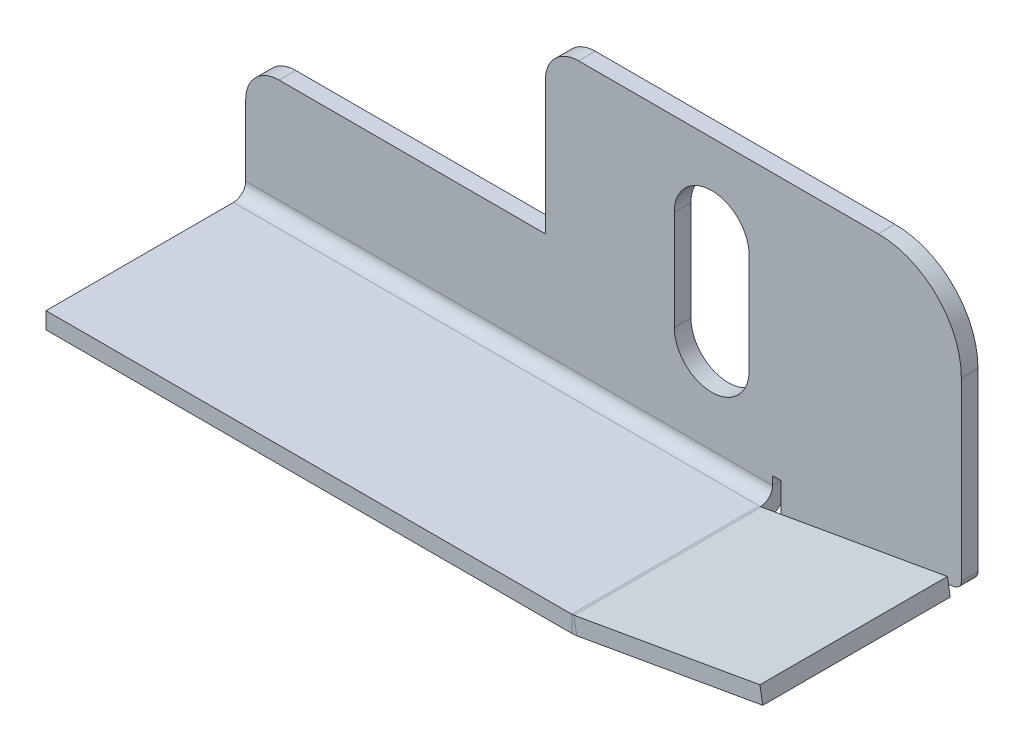
ISO-10303-21;
HEADER;
FILE_DESCRIPTION(('STEP AP214'),'2;1');
FILE_NAME('part.step','',(''),(''),'','','');
FILE_SCHEMA(('AUTOMOTIVE_DESIGN { 1 0 10303 214 1 1 1 1 }'));
ENDSEC;
DATA;
#1=APPLICATION_CONTEXT('core data for automotive mechanical design processes');
#2=APPLICATION_PROTOCOL_DEFINITION('international standard','automotive_design',2000,#1);
#3=PRODUCT_CONTEXT('',#1,'mechanical');
#4=PRODUCT('Part','Part','',(#3));
#5=PRODUCT_RELATED_PRODUCT_CATEGORY('part','',(#4));
#6=PRODUCT_DEFINITION_FORMATION('','',#4);
#7=PRODUCT_DEFINITION_CONTEXT('part definition',#1,'design');
#8=PRODUCT_DEFINITION('design','',#6,#7);
#9=PRODUCT_DEFINITION_SHAPE('','',#8);
#10=(LENGTH_UNIT() NAMED_UNIT(*) SI_UNIT(.MILLI.,.METRE.));
#11=(NAMED_UNIT(*) PLANE_ANGLE_UNIT() SI_UNIT($,.RADIAN.));
#12=(NAMED_UNIT(*) SI_UNIT($,.STERADIAN.) SOLID_ANGLE_UNIT());
#13=UNCERTAINTY_MEASURE_WITH_UNIT(LENGTH_MEASURE(1.E-05),#10,'distance_accuracy_value','');
#14=(GEOMETRIC_REPRESENTATION_CONTEXT(3) GLOBAL_UNCERTAINTY_ASSIGNED_CONTEXT((#13)) GLOBAL_UNIT_ASSIGNED_CONTEXT((#10,
#11,#12)) REPRESENTATION_CONTEXT('',''));
#15=CARTESIAN_POINT('',(0.,0.,0.));
#16=DIRECTION('',(0.,0.,1.));
#17=DIRECTION('',(1.,0.,0.));
#18=AXIS2_PLACEMENT_3D('',#15,#16,#17);
#19=CARTESIAN_POINT('',(0.,0.500000000000003,0.));
#20=DIRECTION('',(0.,1.,0.));
#21=DIRECTION('',(0.,0.,1.));
#22=AXIS2_PLACEMENT_3D('',#19,#20,#21);
#23=PLANE('',#22);
#24=DIRECTION('',(0.,0.,-1.));
#25=VECTOR('',#24,1.);
#26=CARTESIAN_POINT('',(-28.4070077887889,0.499999999999859,1.73660000000001));
#27=LINE('',#26,#25);
#28=CARTESIAN_POINT('',(-28.4070077887889,0.499999999999994,1.73659999999999));
#29=VERTEX_POINT('',#28);
#30=CARTESIAN_POINT('',(-28.4070077887889,0.499999999999953,13.));
#31=VERTEX_POINT('',#30);
#32=EDGE_CURVE('E266',#29,#31,#27,.F.);
#33=ORIENTED_EDGE('',*,*,#32,.T.);
#34=DIRECTION('',(-1.,0.,0.));
#35=VECTOR('',#34,1.);
#36=CARTESIAN_POINT('',(0.,0.499999999999958,13.));
#37=LINE('',#36,#35);
#38=CARTESIAN_POINT('',(-60.,0.499999999999951,13.));
#39=VERTEX_POINT('',#38);
#40=EDGE_CURVE('E636',#31,#39,#37,.T.);
#41=ORIENTED_EDGE('',*,*,#40,.T.);
#42=DIRECTION('',(0.,0.,-1.));
#43=VECTOR('',#42,1.);
#44=CARTESIAN_POINT('',(-60.,0.499999999999996,0.));
#45=LINE('',#44,#43);
#46=CARTESIAN_POINT('',(-60.,0.49999999999999,1.73659999999999));
#47=VERTEX_POINT('',#46);
#48=EDGE_CURVE('E625',#39,#47,#45,.T.);
#49=ORIENTED_EDGE('',*,*,#48,.T.);
#50=DIRECTION('',(1.,0.,0.));
#51=VECTOR('',#50,1.);
#52=CARTESIAN_POINT('',(-60.,0.49999999999999,1.73659999999999));
#53=LINE('',#52,#51);
#54=EDGE_CURVE('E635',#29,#47,#53,.F.);
#55=ORIENTED_EDGE('',*,*,#54,.F.);
#56=EDGE_LOOP('',(#33,#41,#49,#55));
#57=FACE_BOUND('',#56,.T.);
#58=ADVANCED_FACE('F62',(#57),#23,.F.);
#59=CARTESIAN_POINT('',(0.,1.5,0.));
#60=DIRECTION('',(0.,1.,0.));
#61=DIRECTION('',(0.,0.,1.));
#62=AXIS2_PLACEMENT_3D('',#59,#60,#61);
#63=PLANE('',#62);
#64=DIRECTION('',(1.,0.,0.));
#65=VECTOR('',#64,1.);
#66=CARTESIAN_POINT('',(-60.,1.49999999999995,13.));
#67=LINE('',#66,#65);
#68=CARTESIAN_POINT('',(-28.4070077887889,1.49999999999995,13.));
#69=VERTEX_POINT('',#68);
#70=CARTESIAN_POINT('',(-60.,1.49999999999995,13.));
#71=VERTEX_POINT('',#70);
#72=EDGE_CURVE('E650',#69,#71,#67,.F.);
#73=ORIENTED_EDGE('',*,*,#72,.F.);
#74=DIRECTION('',(0.,0.,-1.));
#75=VECTOR('',#74,1.);
#76=CARTESIAN_POINT('',(-28.4070077887889,1.49999999999986,1.7366));
#77=LINE('',#76,#75);
#78=CARTESIAN_POINT('',(-28.4070077887889,1.49999999999986,1.7366));
#79=VERTEX_POINT('',#78);
#80=EDGE_CURVE('E753',#79,#69,#77,.F.);
#81=ORIENTED_EDGE('',*,*,#80,.F.);
#82=DIRECTION('',(1.,0.,0.));
#83=VECTOR('',#82,1.);
#84=CARTESIAN_POINT('',(-60.,1.49999999999999,1.7366));
#85=LINE('',#84,#83);
#86=CARTESIAN_POINT('',(-60.,1.49999999999999,1.7366));
#87=VERTEX_POINT('',#86);
#88=EDGE_CURVE('E632',#87,#79,#85,.T.);
#89=ORIENTED_EDGE('',*,*,#88,.F.);
#90=DIRECTION('',(0.,0.,1.));
#91=VECTOR('',#90,1.);
#92=CARTESIAN_POINT('',(-60.,1.49999999999999,1.));
#93=LINE('',#92,#91);
#94=EDGE_CURVE('E627',#71,#87,#93,.F.);
#95=ORIENTED_EDGE('',*,*,#94,.F.);
#96=EDGE_LOOP('',(#73,#81,#89,#95));
#97=FACE_BOUND('',#96,.T.);
#98=ADVANCED_FACE('F601',(#97),#63,.T.);
#99=CARTESIAN_POINT('',(-60.,0.499999999999951,13.));
#100=DIRECTION('',(0.,0.,-1.));
#101=DIRECTION('',(0.,1.,0.));
#102=AXIS2_PLACEMENT_3D('',#99,#100,#101);
#103=PLANE('',#102);
#104=DIRECTION('',(0.,-1.,0.));
#105=VECTOR('',#104,1.);
#106=CARTESIAN_POINT('',(-28.4070077887889,1.49999999999995,13.));
#107=LINE('',#106,#105);
#108=EDGE_CURVE('E716',#69,#31,#107,.T.);
#109=ORIENTED_EDGE('',*,*,#108,.F.);
#110=ORIENTED_EDGE('',*,*,#72,.T.);
#111=DIRECTION('',(0.,1.,0.));
#112=VECTOR('',#111,1.);
#113=CARTESIAN_POINT('',(-60.,0.499999999999951,13.));
#114=LINE('',#113,#112);
#115=EDGE_CURVE('E639',#39,#71,#114,.T.);
#116=ORIENTED_EDGE('',*,*,#115,.F.);
#117=ORIENTED_EDGE('',*,*,#40,.F.);
#118=EDGE_LOOP('',(#109,#110,#116,#117));
#119=FACE_BOUND('',#118,.T.);
#120=ADVANCED_FACE('F512',(#119),#103,.F.);
#121=CARTESIAN_POINT('',(-58.,6.49999999999999,1.));
#122=DIRECTION('',(0.,0.,1.));
#123=DIRECTION('',(1.,0.,0.));
#124=AXIS2_PLACEMENT_3D('',#121,#122,#123);
#125=PLANE('',#124);
#126=DIRECTION('',(0.,1.,0.));
#127=VECTOR('',#126,1.);
#128=CARTESIAN_POINT('',(-29.75,7.5,1.));
#129=LINE('',#128,#127);
#130=CARTESIAN_POINT('',(-29.75,7.5,1.));
#131=VERTEX_POINT('',#130);
#132=CARTESIAN_POINT('',(-29.75,13.5,1.));
#133=VERTEX_POINT('',#132);
#134=EDGE_CURVE('E373',#131,#133,#129,.T.);
#135=ORIENTED_EDGE('',*,*,#134,.F.);
#136=CARTESIAN_POINT('',(-32.,7.5,1.));
#137=DIRECTION('',(0.,0.,1.));
#138=DIRECTION('',(-1.,0.,0.));
#139=AXIS2_PLACEMENT_3D('',#136,#137,#138);
#140=CIRCLE('',#139,2.25);
#141=CARTESIAN_POINT('',(-34.25,7.5,1.));
#142=VERTEX_POINT('',#141);
#143=EDGE_CURVE('E370',#142,#131,#140,.T.);
#144=ORIENTED_EDGE('',*,*,#143,.F.);
#145=DIRECTION('',(0.,-1.,0.));
#146=VECTOR('',#145,1.);
#147=CARTESIAN_POINT('',(-34.25,7.5,1.));
#148=LINE('',#147,#146);
#149=CARTESIAN_POINT('',(-34.25,13.5,1.));
#150=VERTEX_POINT('',#149);
#151=EDGE_CURVE('E381',#150,#142,#148,.T.);
#152=ORIENTED_EDGE('',*,*,#151,.F.);
#153=CARTESIAN_POINT('',(-32.,13.5,1.));
#154=DIRECTION('',(0.,0.,1.));
#155=DIRECTION('',(-1.,0.,0.));
#156=AXIS2_PLACEMENT_3D('',#153,#154,#155);
#157=CIRCLE('',#156,2.25);
#158=EDGE_CURVE('E377',#133,#150,#157,.T.);
#159=ORIENTED_EDGE('',*,*,#158,.F.);
#160=EDGE_LOOP('',(#135,#144,#152,#159));
#161=FACE_BOUND('',#160,.T.);
#162=DIRECTION('',(0.,1.,0.));
#163=VECTOR('',#162,1.);
#164=CARTESIAN_POINT('',(-27.8425636392357,0.588163490354227,0.999999999999999));
#165=LINE('',#164,#163);
#166=CARTESIAN_POINT('',(-27.8425636392357,1.18404028665133,0.999999999999999));
#167=VERTEX_POINT('',#166);
#168=CARTESIAN_POINT('',(-27.8425636392357,2.73659999999999,1.));
#169=VERTEX_POINT('',#168);
#170=EDGE_CURVE('E335',#167,#169,#165,.T.);
#171=ORIENTED_EDGE('',*,*,#170,.F.);
#172=CARTESIAN_POINT('',(-27.3425636392357,1.18404028665133,1.));
#173=DIRECTION('',(0.,0.,1.));
#174=DIRECTION('',(1.,0.,0.));
#175=AXIS2_PLACEMENT_3D('',#172,#173,#174);
#176=CIRCLE('',#175,0.5);
#177=CARTESIAN_POINT('',(-27.2557395504022,0.691636410145227,1.));
#178=VERTEX_POINT('',#177);
#179=EDGE_CURVE('E71',#167,#178,#176,.T.);
#180=ORIENTED_EDGE('',*,*,#179,.T.);
#181=DIRECTION('',(0.984807753012209,0.173648177666927,0.));
#182=VECTOR('',#181,1.);
#183=CARTESIAN_POINT('',(-17.,2.5,1.));
#184=LINE('',#183,#182);
#185=CARTESIAN_POINT('',(-17.4131759111665,2.42714593908254,1.));
#186=VERTEX_POINT('',#185);
#187=EDGE_CURVE('E333',#178,#186,#184,.T.);
#188=ORIENTED_EDGE('',*,*,#187,.T.);
#189=CARTESIAN_POINT('',(-17.5,2.91954981558865,1.));
#190=DIRECTION('',(0.,0.,1.));
#191=DIRECTION('',(1.,0.,0.));
#192=AXIS2_PLACEMENT_3D('',#189,#190,#191);
#193=CIRCLE('',#192,0.5);
#194=CARTESIAN_POINT('',(-17.,2.91954981558865,1.));
#195=VERTEX_POINT('',#194);
#196=EDGE_CURVE('E78',#186,#195,#193,.T.);
#197=ORIENTED_EDGE('',*,*,#196,.T.);
#198=DIRECTION('',(0.,1.,0.));
#199=VECTOR('',#198,1.);
#200=CARTESIAN_POINT('',(-17.,13.5,1.));
#201=LINE('',#200,#199);
#202=CARTESIAN_POINT('',(-17.,13.5,1.));
#203=VERTEX_POINT('',#202);
#204=EDGE_CURVE('E344',#195,#203,#201,.T.);
#205=ORIENTED_EDGE('',*,*,#204,.T.);
#206=CARTESIAN_POINT('',(-22.,13.5,1.));
#207=DIRECTION('',(0.,0.,1.));
#208=DIRECTION('',(1.,0.,0.));
#209=AXIS2_PLACEMENT_3D('',#206,#207,#208);
#210=CIRCLE('',#209,5.);
#211=CARTESIAN_POINT('',(-22.,18.5,1.));
#212=VERTEX_POINT('',#211);
#213=EDGE_CURVE('E415',#203,#212,#210,.T.);
#214=ORIENTED_EDGE('',*,*,#213,.T.);
#215=DIRECTION('',(-1.,0.,0.));
#216=VECTOR('',#215,1.);
#217=CARTESIAN_POINT('',(-40.,18.5,1.));
#218=LINE('',#217,#216);
#219=CARTESIAN_POINT('',(-40.,18.5,1.));
#220=VERTEX_POINT('',#219);
#221=EDGE_CURVE('E418',#212,#220,#218,.T.);
#222=ORIENTED_EDGE('',*,*,#221,.T.);
#223=CARTESIAN_POINT('',(-40.,16.5,1.));
#224=DIRECTION('',(0.,0.,1.));
#225=DIRECTION('',(-1.,0.,0.));
#226=AXIS2_PLACEMENT_3D('',#223,#224,#225);
#227=CIRCLE('',#226,1.99999999999999);
#228=CARTESIAN_POINT('',(-42.,16.5,1.));
#229=VERTEX_POINT('',#228);
#230=EDGE_CURVE('E421',#220,#229,#227,.T.);
#231=ORIENTED_EDGE('',*,*,#230,.T.);
#232=DIRECTION('',(0.,-1.,0.));
#233=VECTOR('',#232,1.);
#234=CARTESIAN_POINT('',(-42.,8.49999999999999,1.));
#235=LINE('',#234,#233);
#236=CARTESIAN_POINT('',(-42.,8.49999999999999,1.));
#237=VERTEX_POINT('',#236);
#238=EDGE_CURVE('E424',#229,#237,#235,.T.);
#239=ORIENTED_EDGE('',*,*,#238,.T.);
#240=DIRECTION('',(-1.,0.,0.));
#241=VECTOR('',#240,1.);
#242=CARTESIAN_POINT('',(-42.,8.49999999999999,1.));
#243=LINE('',#242,#241);
#244=CARTESIAN_POINT('',(-58.,8.49999999999999,1.));
#245=VERTEX_POINT('',#244);
#246=EDGE_CURVE('E427',#237,#245,#243,.T.);
#247=ORIENTED_EDGE('',*,*,#246,.T.);
#248=CARTESIAN_POINT('',(-58.,6.49999999999999,1.));
#249=DIRECTION('',(0.,0.,1.));
#250=DIRECTION('',(1.,0.,0.));
#251=AXIS2_PLACEMENT_3D('',#248,#249,#250);
#252=CIRCLE('',#251,2.);
#253=CARTESIAN_POINT('',(-60.,6.49999999999999,1.));
#254=VERTEX_POINT('',#253);
#255=EDGE_CURVE('E430',#245,#254,#252,.T.);
#256=ORIENTED_EDGE('',*,*,#255,.T.);
#257=DIRECTION('',(0.,-1.,0.));
#258=VECTOR('',#257,1.);
#259=CARTESIAN_POINT('',(-60.,0.499999999999993,1.));
#260=LINE('',#259,#258);
#261=CARTESIAN_POINT('',(-60.,2.23659999999999,1.));
#262=VERTEX_POINT('',#261);
#263=EDGE_CURVE('E345',#254,#262,#260,.T.);
#264=ORIENTED_EDGE('',*,*,#263,.T.);
#265=DIRECTION('',(1.,0.,0.));
#266=VECTOR('',#265,1.);
#267=CARTESIAN_POINT('',(-28.3425636392357,2.23659999999999,0.999999999999998));
#268=LINE('',#267,#266);
#269=CARTESIAN_POINT('',(-28.3425636392357,2.23659999999999,1.));
#270=VERTEX_POINT('',#269);
#271=EDGE_CURVE('E666',#270,#262,#268,.F.);
#272=ORIENTED_EDGE('',*,*,#271,.F.);
#273=DIRECTION('',(0.,-1.,0.));
#274=VECTOR('',#273,1.);
#275=CARTESIAN_POINT('',(-28.3425636392357,2.73659999999999,0.999999999999998));
#276=LINE('',#275,#274);
#277=CARTESIAN_POINT('',(-28.3425636392357,2.7366,1.));
#278=VERTEX_POINT('',#277);
#279=EDGE_CURVE('E683',#278,#270,#276,.T.);
#280=ORIENTED_EDGE('',*,*,#279,.F.);
#281=DIRECTION('',(-1.,0.,0.));
#282=VECTOR('',#281,1.);
#283=CARTESIAN_POINT('',(-27.8425636392357,2.73659999999999,0.999999999999998));
#284=LINE('',#283,#282);
#285=EDGE_CURVE('E365',#169,#278,#284,.T.);
#286=ORIENTED_EDGE('',*,*,#285,.F.);
#287=EDGE_LOOP('',(#171,#180,#188,#197,#205,#214,#222,#231,#239,#247,#256,#264,#272,#280,#286));
#288=FACE_BOUND('',#287,.T.);
#289=ADVANCED_FACE('F332',(#161,#288),#125,.T.);
#290=CARTESIAN_POINT('',(-58.,6.49999999999999,0.));
#291=DIRECTION('',(0.,0.,1.));
#292=DIRECTION('',(1.,0.,0.));
#293=AXIS2_PLACEMENT_3D('',#290,#291,#292);
#294=PLANE('',#293);
#295=CARTESIAN_POINT('',(-32.,7.5,0.));
#296=DIRECTION('',(0.,0.,1.));
#297=DIRECTION('',(-1.,0.,0.));
#298=AXIS2_PLACEMENT_3D('',#295,#296,#297);
#299=CIRCLE('',#298,2.25);
#300=CARTESIAN_POINT('',(-34.25,7.5,0.));
#301=VERTEX_POINT('',#300);
#302=CARTESIAN_POINT('',(-29.75,7.5,0.));
#303=VERTEX_POINT('',#302);
#304=EDGE_CURVE('E358',#301,#303,#299,.T.);
#305=ORIENTED_EDGE('',*,*,#304,.T.);
#306=DIRECTION('',(0.,1.,0.));
#307=VECTOR('',#306,1.);
#308=CARTESIAN_POINT('',(-29.75,7.5,0.));
#309=LINE('',#308,#307);
#310=CARTESIAN_POINT('',(-29.75,13.5,0.));
#311=VERTEX_POINT('',#310);
#312=EDGE_CURVE('E363',#303,#311,#309,.T.);
#313=ORIENTED_EDGE('',*,*,#312,.T.);
#314=CARTESIAN_POINT('',(-32.,13.5,0.));
#315=DIRECTION('',(0.,0.,1.));
#316=DIRECTION('',(-1.,0.,0.));
#317=AXIS2_PLACEMENT_3D('',#314,#315,#316);
#318=CIRCLE('',#317,2.25);
#319=CARTESIAN_POINT('',(-34.25,13.5,0.));
#320=VERTEX_POINT('',#319);
#321=EDGE_CURVE('E388',#311,#320,#318,.T.);
#322=ORIENTED_EDGE('',*,*,#321,.T.);
#323=DIRECTION('',(0.,-1.,0.));
#324=VECTOR('',#323,1.);
#325=CARTESIAN_POINT('',(-34.25,7.5,0.));
#326=LINE('',#325,#324);
#327=EDGE_CURVE('E374',#320,#301,#326,.T.);
#328=ORIENTED_EDGE('',*,*,#327,.T.);
#329=EDGE_LOOP('',(#305,#313,#322,#328));
#330=FACE_BOUND('',#329,.T.);
#331=DIRECTION('',(0.984807753012209,0.173648177666927,0.));
#332=VECTOR('',#331,1.);
#333=CARTESIAN_POINT('',(-17.,2.5,0.));
#334=LINE('',#333,#332);
#335=CARTESIAN_POINT('',(-27.2557395504022,0.691636410145227,0.));
#336=VERTEX_POINT('',#335);
#337=CARTESIAN_POINT('',(-17.4131759111665,2.42714593908254,0.));
#338=VERTEX_POINT('',#337);
#339=EDGE_CURVE('E352',#336,#338,#334,.T.);
#340=ORIENTED_EDGE('',*,*,#339,.F.);
#341=CARTESIAN_POINT('',(-27.3425636392357,1.18404028665133,0.));
#342=DIRECTION('',(0.,0.,1.));
#343=DIRECTION('',(1.,0.,0.));
#344=AXIS2_PLACEMENT_3D('',#341,#342,#343);
#345=CIRCLE('',#344,0.5);
#346=CARTESIAN_POINT('',(-27.8425636392357,1.18404028665133,0.));
#347=VERTEX_POINT('',#346);
#348=EDGE_CURVE('E323',#336,#347,#345,.F.);
#349=ORIENTED_EDGE('',*,*,#348,.T.);
#350=DIRECTION('',(0.,-1.,0.));
#351=VECTOR('',#350,1.);
#352=CARTESIAN_POINT('',(-27.8425636392357,6.49999999999999,0.));
#353=LINE('',#352,#351);
#354=CARTESIAN_POINT('',(-27.8425636392357,2.7366,0.));
#355=VERTEX_POINT('',#354);
#356=EDGE_CURVE('E350',#355,#347,#353,.T.);
#357=ORIENTED_EDGE('',*,*,#356,.F.);
#358=DIRECTION('',(1.,0.,0.));
#359=VECTOR('',#358,1.);
#360=CARTESIAN_POINT('',(-58.,2.7366,0.));
#361=LINE('',#360,#359);
#362=CARTESIAN_POINT('',(-28.3425636392357,2.7366,0.));
#363=VERTEX_POINT('',#362);
#364=EDGE_CURVE('E316',#363,#355,#361,.T.);
#365=ORIENTED_EDGE('',*,*,#364,.F.);
#366=DIRECTION('',(0.,1.,0.));
#367=VECTOR('',#366,1.);
#368=CARTESIAN_POINT('',(-28.3425636392357,6.49999999999999,0.));
#369=LINE('',#368,#367);
#370=CARTESIAN_POINT('',(-28.3425636392357,2.2366,0.));
#371=VERTEX_POINT('',#370);
#372=EDGE_CURVE('E486',#371,#363,#369,.T.);
#373=ORIENTED_EDGE('',*,*,#372,.F.);
#374=DIRECTION('',(1.,0.,0.));
#375=VECTOR('',#374,1.);
#376=CARTESIAN_POINT('',(-28.3425636392357,2.2366,0.));
#377=LINE('',#376,#375);
#378=CARTESIAN_POINT('',(-60.,2.2366,0.));
#379=VERTEX_POINT('',#378);
#380=EDGE_CURVE('E656',#371,#379,#377,.F.);
#381=ORIENTED_EDGE('',*,*,#380,.T.);
#382=DIRECTION('',(0.,-1.,0.));
#383=VECTOR('',#382,1.);
#384=CARTESIAN_POINT('',(-60.,0.499999999999993,0.));
#385=LINE('',#384,#383);
#386=CARTESIAN_POINT('',(-60.,6.49999999999999,0.));
#387=VERTEX_POINT('',#386);
#388=EDGE_CURVE('E408',#387,#379,#385,.T.);
#389=ORIENTED_EDGE('',*,*,#388,.F.);
#390=CARTESIAN_POINT('',(-58.,6.49999999999999,0.));
#391=DIRECTION('',(0.,0.,1.));
#392=DIRECTION('',(1.,0.,0.));
#393=AXIS2_PLACEMENT_3D('',#390,#391,#392);
#394=CIRCLE('',#393,2.);
#395=CARTESIAN_POINT('',(-58.,8.49999999999999,0.));
#396=VERTEX_POINT('',#395);
#397=EDGE_CURVE('E411',#396,#387,#394,.T.);
#398=ORIENTED_EDGE('',*,*,#397,.F.);
#399=DIRECTION('',(-1.,0.,0.));
#400=VECTOR('',#399,1.);
#401=CARTESIAN_POINT('',(-42.,8.49999999999999,0.));
#402=LINE('',#401,#400);
#403=CARTESIAN_POINT('',(-42.,8.49999999999999,0.));
#404=VERTEX_POINT('',#403);
#405=EDGE_CURVE('E454',#404,#396,#402,.T.);
#406=ORIENTED_EDGE('',*,*,#405,.F.);
#407=DIRECTION('',(0.,-1.,0.));
#408=VECTOR('',#407,1.);
#409=CARTESIAN_POINT('',(-42.,8.49999999999999,0.));
#410=LINE('',#409,#408);
#411=CARTESIAN_POINT('',(-42.,16.5,0.));
#412=VERTEX_POINT('',#411);
#413=EDGE_CURVE('E451',#412,#404,#410,.T.);
#414=ORIENTED_EDGE('',*,*,#413,.F.);
#415=CARTESIAN_POINT('',(-40.,16.5,0.));
#416=DIRECTION('',(0.,0.,1.));
#417=DIRECTION('',(-1.,0.,0.));
#418=AXIS2_PLACEMENT_3D('',#415,#416,#417);
#419=CIRCLE('',#418,1.99999999999999);
#420=CARTESIAN_POINT('',(-40.,18.5,0.));
#421=VERTEX_POINT('',#420);
#422=EDGE_CURVE('E448',#421,#412,#419,.T.);
#423=ORIENTED_EDGE('',*,*,#422,.F.);
#424=DIRECTION('',(-1.,0.,0.));
#425=VECTOR('',#424,1.);
#426=CARTESIAN_POINT('',(-40.,18.5,0.));
#427=LINE('',#426,#425);
#428=CARTESIAN_POINT('',(-22.,18.5,0.));
#429=VERTEX_POINT('',#428);
#430=EDGE_CURVE('E445',#429,#421,#427,.T.);
#431=ORIENTED_EDGE('',*,*,#430,.F.);
#432=CARTESIAN_POINT('',(-22.,13.5,0.));
#433=DIRECTION('',(0.,0.,1.));
#434=DIRECTION('',(1.,0.,0.));
#435=AXIS2_PLACEMENT_3D('',#432,#433,#434);
#436=CIRCLE('',#435,5.);
#437=CARTESIAN_POINT('',(-17.,13.5,0.));
#438=VERTEX_POINT('',#437);
#439=EDGE_CURVE('E442',#438,#429,#436,.T.);
#440=ORIENTED_EDGE('',*,*,#439,.F.);
#441=DIRECTION('',(0.,1.,0.));
#442=VECTOR('',#441,1.);
#443=CARTESIAN_POINT('',(-17.,13.5,0.));
#444=LINE('',#443,#442);
#445=CARTESIAN_POINT('',(-17.,2.91954981558865,0.));
#446=VERTEX_POINT('',#445);
#447=EDGE_CURVE('E439',#446,#438,#444,.T.);
#448=ORIENTED_EDGE('',*,*,#447,.F.);
#449=CARTESIAN_POINT('',(-17.5,2.91954981558865,0.));
#450=DIRECTION('',(0.,0.,1.));
#451=DIRECTION('',(1.,0.,0.));
#452=AXIS2_PLACEMENT_3D('',#449,#450,#451);
#453=CIRCLE('',#452,0.5);
#454=EDGE_CURVE('E320',#446,#338,#453,.F.);
#455=ORIENTED_EDGE('',*,*,#454,.T.);
#456=EDGE_LOOP('',(#340,#349,#357,#365,#373,#381,#389,#398,#406,#414,#423,#431,#440,#448,#455));
#457=FACE_BOUND('',#456,.T.);
#458=ADVANCED_FACE('F349',(#330,#457),#294,.F.);
#459=CARTESIAN_POINT('',(-60.,0.499999999999993,1.));
#460=DIRECTION('',(1.,0.,0.));
#461=DIRECTION('',(0.,0.,-1.));
#462=AXIS2_PLACEMENT_3D('',#459,#460,#461);
#463=PLANE('',#462);
#464=DIRECTION('',(0.,0.,-1.));
#465=VECTOR('',#464,1.);
#466=CARTESIAN_POINT('',(-60.,2.23659999999999,0.999999999999998));
#467=LINE('',#466,#465);
#468=EDGE_CURVE('E673',#262,#379,#467,.T.);
#469=ORIENTED_EDGE('',*,*,#468,.F.);
#470=ORIENTED_EDGE('',*,*,#263,.F.);
#471=DIRECTION('',(0.,0.,-1.));
#472=VECTOR('',#471,1.);
#473=CARTESIAN_POINT('',(-60.,6.49999999999999,1.));
#474=LINE('',#473,#472);
#475=EDGE_CURVE('E433',#254,#387,#474,.T.);
#476=ORIENTED_EDGE('',*,*,#475,.T.);
#477=ORIENTED_EDGE('',*,*,#388,.T.);
#478=EDGE_LOOP('',(#469,#470,#476,#477));
#479=FACE_BOUND('',#478,.T.);
#480=ADVANCED_FACE('F557',(#479),#463,.F.);
#481=CARTESIAN_POINT('',(-17.,2.5,1.));
#482=DIRECTION('',(-0.173648177666927,0.984807753012209,0.));
#483=DIRECTION('',(-0.984807753012209,-0.173648177666927,0.));
#484=AXIS2_PLACEMENT_3D('',#481,#482,#483);
#485=PLANE('',#484);
#486=ORIENTED_EDGE('',*,*,#187,.F.);
#487=DIRECTION('',(0.,0.,-1.));
#488=VECTOR('',#487,1.);
#489=CARTESIAN_POINT('',(-27.2557395504022,0.691636410145226,0.));
#490=LINE('',#489,#488);
#491=EDGE_CURVE('E315',#178,#336,#490,.T.);
#492=ORIENTED_EDGE('',*,*,#491,.T.);
#493=ORIENTED_EDGE('',*,*,#339,.T.);
#494=DIRECTION('',(0.,0.,-1.));
#495=VECTOR('',#494,1.);
#496=CARTESIAN_POINT('',(-17.4131759111665,2.42714593908254,1.));
#497=LINE('',#496,#495);
#498=EDGE_CURVE('E312',#338,#186,#497,.F.);
#499=ORIENTED_EDGE('',*,*,#498,.T.);
#500=EDGE_LOOP('',(#486,#492,#493,#499));
#501=FACE_BOUND('',#500,.T.);
#502=ADVANCED_FACE('F339',(#501),#485,.F.);
#503=CARTESIAN_POINT('',(-17.,13.5,1.));
#504=DIRECTION('',(-1.,0.,0.));
#505=DIRECTION('',(0.,-1.,0.));
#506=AXIS2_PLACEMENT_3D('',#503,#504,#505);
#507=PLANE('',#506);
#508=ORIENTED_EDGE('',*,*,#204,.F.);
#509=DIRECTION('',(0.,0.,-1.));
#510=VECTOR('',#509,1.);
#511=CARTESIAN_POINT('',(-17.,2.91954981558865,1.));
#512=LINE('',#511,#510);
#513=EDGE_CURVE('E13',#195,#446,#512,.T.);
#514=ORIENTED_EDGE('',*,*,#513,.T.);
#515=ORIENTED_EDGE('',*,*,#447,.T.);
#516=DIRECTION('',(0.,0.,-1.));
#517=VECTOR('',#516,1.);
#518=CARTESIAN_POINT('',(-17.,13.5,1.));
#519=LINE('',#518,#517);
#520=EDGE_CURVE('E482',#203,#438,#519,.T.);
#521=ORIENTED_EDGE('',*,*,#520,.F.);
#522=EDGE_LOOP('',(#508,#514,#515,#521));
#523=FACE_BOUND('',#522,.T.);
#524=ADVANCED_FACE('F581',(#523),#507,.F.);
#525=CARTESIAN_POINT('',(-22.,13.5,1.));
#526=DIRECTION('',(0.,0.,-1.));
#527=DIRECTION('',(-1.,0.,0.));
#528=AXIS2_PLACEMENT_3D('',#525,#526,#527);
#529=CYLINDRICAL_SURFACE('',#528,5.);
#530=ORIENTED_EDGE('',*,*,#439,.T.);
#531=DIRECTION('',(0.,0.,-1.));
#532=VECTOR('',#531,1.);
#533=CARTESIAN_POINT('',(-22.,18.5,1.));
#534=LINE('',#533,#532);
#535=EDGE_CURVE('E478',#212,#429,#534,.T.);
#536=ORIENTED_EDGE('',*,*,#535,.F.);
#537=ORIENTED_EDGE('',*,*,#213,.F.);
#538=ORIENTED_EDGE('',*,*,#520,.T.);
#539=EDGE_LOOP('',(#530,#536,#537,#538));
#540=FACE_BOUND('',#539,.T.);
#541=ADVANCED_FACE('F577',(#540),#529,.T.);
#542=CARTESIAN_POINT('',(-40.,18.5,1.));
#543=DIRECTION('',(0.,-1.,0.));
#544=DIRECTION('',(1.,0.,0.));
#545=AXIS2_PLACEMENT_3D('',#542,#543,#544);
#546=PLANE('',#545);
#547=ORIENTED_EDGE('',*,*,#430,.T.);
#548=DIRECTION('',(0.,0.,-1.));
#549=VECTOR('',#548,1.);
#550=CARTESIAN_POINT('',(-40.,18.5,1.));
#551=LINE('',#550,#549);
#552=EDGE_CURVE('E474',#220,#421,#551,.T.);
#553=ORIENTED_EDGE('',*,*,#552,.F.);
#554=ORIENTED_EDGE('',*,*,#221,.F.);
#555=ORIENTED_EDGE('',*,*,#535,.T.);
#556=EDGE_LOOP('',(#547,#553,#554,#555));
#557=FACE_BOUND('',#556,.T.);
#558=ADVANCED_FACE('F573',(#557),#546,.F.);
#559=CARTESIAN_POINT('',(-40.,16.5,1.));
#560=DIRECTION('',(0.,0.,-1.));
#561=DIRECTION('',(-1.,0.,0.));
#562=AXIS2_PLACEMENT_3D('',#559,#560,#561);
#563=CYLINDRICAL_SURFACE('',#562,1.99999999999999);
#564=ORIENTED_EDGE('',*,*,#422,.T.);
#565=DIRECTION('',(0.,0.,-1.));
#566=VECTOR('',#565,1.);
#567=CARTESIAN_POINT('',(-42.,16.5,1.));
#568=LINE('',#567,#566);
#569=EDGE_CURVE('E470',#229,#412,#568,.T.);
#570=ORIENTED_EDGE('',*,*,#569,.F.);
#571=ORIENTED_EDGE('',*,*,#230,.F.);
#572=ORIENTED_EDGE('',*,*,#552,.T.);
#573=EDGE_LOOP('',(#564,#570,#571,#572));
#574=FACE_BOUND('',#573,.T.);
#575=ADVANCED_FACE('F569',(#574),#563,.T.);
#576=CARTESIAN_POINT('',(-42.,8.49999999999999,1.));
#577=DIRECTION('',(1.,0.,0.));
#578=DIRECTION('',(0.,0.,-1.));
#579=AXIS2_PLACEMENT_3D('',#576,#577,#578);
#580=PLANE('',#579);
#581=ORIENTED_EDGE('',*,*,#413,.T.);
#582=DIRECTION('',(0.,0.,-1.));
#583=VECTOR('',#582,1.);
#584=CARTESIAN_POINT('',(-42.,8.49999999999999,1.));
#585=LINE('',#584,#583);
#586=EDGE_CURVE('E466',#237,#404,#585,.T.);
#587=ORIENTED_EDGE('',*,*,#586,.F.);
#588=ORIENTED_EDGE('',*,*,#238,.F.);
#589=ORIENTED_EDGE('',*,*,#569,.T.);
#590=EDGE_LOOP('',(#581,#587,#588,#589));
#591=FACE_BOUND('',#590,.T.);
#592=ADVANCED_FACE('F565',(#591),#580,.F.);
#593=CARTESIAN_POINT('',(-42.,8.49999999999999,1.));
#594=DIRECTION('',(0.,-1.,0.));
#595=DIRECTION('',(1.,0.,0.));
#596=AXIS2_PLACEMENT_3D('',#593,#594,#595);
#597=PLANE('',#596);
#598=ORIENTED_EDGE('',*,*,#405,.T.);
#599=DIRECTION('',(0.,0.,-1.));
#600=VECTOR('',#599,1.);
#601=CARTESIAN_POINT('',(-58.,8.49999999999999,1.));
#602=LINE('',#601,#600);
#603=EDGE_CURVE('E462',#245,#396,#602,.T.);
#604=ORIENTED_EDGE('',*,*,#603,.F.);
#605=ORIENTED_EDGE('',*,*,#246,.F.);
#606=ORIENTED_EDGE('',*,*,#586,.T.);
#607=EDGE_LOOP('',(#598,#604,#605,#606));
#608=FACE_BOUND('',#607,.T.);
#609=ADVANCED_FACE('F561',(#608),#597,.F.);
#610=CARTESIAN_POINT('',(-58.,6.49999999999999,1.));
#611=DIRECTION('',(0.,0.,-1.));
#612=DIRECTION('',(-1.,0.,0.));
#613=AXIS2_PLACEMENT_3D('',#610,#611,#612);
#614=CYLINDRICAL_SURFACE('',#613,2.);
#615=ORIENTED_EDGE('',*,*,#397,.T.);
#616=ORIENTED_EDGE('',*,*,#475,.F.);
#617=ORIENTED_EDGE('',*,*,#255,.F.);
#618=ORIENTED_EDGE('',*,*,#603,.T.);
#619=EDGE_LOOP('',(#615,#616,#617,#618));
#620=FACE_BOUND('',#619,.T.);
#621=ADVANCED_FACE('F550',(#620),#614,.T.);
#622=CARTESIAN_POINT('',(-32.,7.5,1.));
#623=DIRECTION('',(0.,0.,-1.));
#624=DIRECTION('',(-1.,0.,0.));
#625=AXIS2_PLACEMENT_3D('',#622,#623,#624);
#626=CYLINDRICAL_SURFACE('',#625,2.25);
#627=ORIENTED_EDGE('',*,*,#304,.F.);
#628=DIRECTION('',(0.,0.,-1.));
#629=VECTOR('',#628,1.);
#630=CARTESIAN_POINT('',(-34.25,7.5,1.));
#631=LINE('',#630,#629);
#632=EDGE_CURVE('E383',#142,#301,#631,.T.);
#633=ORIENTED_EDGE('',*,*,#632,.F.);
#634=ORIENTED_EDGE('',*,*,#143,.T.);
#635=DIRECTION('',(0.,0.,-1.));
#636=VECTOR('',#635,1.);
#637=CARTESIAN_POINT('',(-29.75,7.5,1.));
#638=LINE('',#637,#636);
#639=EDGE_CURVE('E404',#131,#303,#638,.T.);
#640=ORIENTED_EDGE('',*,*,#639,.T.);
#641=EDGE_LOOP('',(#627,#633,#634,#640));
#642=FACE_BOUND('',#641,.T.);
#643=ADVANCED_FACE('F546',(#642),#626,.F.);
#644=CARTESIAN_POINT('',(-29.75,7.5,1.));
#645=DIRECTION('',(-1.,0.,0.));
#646=DIRECTION('',(0.,0.,1.));
#647=AXIS2_PLACEMENT_3D('',#644,#645,#646);
#648=PLANE('',#647);
#649=ORIENTED_EDGE('',*,*,#312,.F.);
#650=ORIENTED_EDGE('',*,*,#639,.F.);
#651=ORIENTED_EDGE('',*,*,#134,.T.);
#652=DIRECTION('',(0.,0.,-1.));
#653=VECTOR('',#652,1.);
#654=CARTESIAN_POINT('',(-29.75,13.5,1.));
#655=LINE('',#654,#653);
#656=EDGE_CURVE('E401',#133,#311,#655,.T.);
#657=ORIENTED_EDGE('',*,*,#656,.T.);
#658=EDGE_LOOP('',(#649,#650,#651,#657));
#659=FACE_BOUND('',#658,.T.);
#660=ADVANCED_FACE('F542',(#659),#648,.T.);
#661=CARTESIAN_POINT('',(-32.,13.5,1.));
#662=DIRECTION('',(0.,0.,-1.));
#663=DIRECTION('',(-1.,0.,0.));
#664=AXIS2_PLACEMENT_3D('',#661,#662,#663);
#665=CYLINDRICAL_SURFACE('',#664,2.25);
#666=ORIENTED_EDGE('',*,*,#321,.F.);
#667=ORIENTED_EDGE('',*,*,#656,.F.);
#668=ORIENTED_EDGE('',*,*,#158,.T.);
#669=DIRECTION('',(0.,0.,-1.));
#670=VECTOR('',#669,1.);
#671=CARTESIAN_POINT('',(-34.25,13.5,1.));
#672=LINE('',#671,#670);
#673=EDGE_CURVE('E398',#150,#320,#672,.T.);
#674=ORIENTED_EDGE('',*,*,#673,.T.);
#675=EDGE_LOOP('',(#666,#667,#668,#674));
#676=FACE_BOUND('',#675,.T.);
#677=ADVANCED_FACE('F538',(#676),#665,.F.);
#678=CARTESIAN_POINT('',(-34.25,7.5,1.));
#679=DIRECTION('',(1.,0.,0.));
#680=DIRECTION('',(0.,0.,-1.));
#681=AXIS2_PLACEMENT_3D('',#678,#679,#680);
#682=PLANE('',#681);
#683=ORIENTED_EDGE('',*,*,#327,.F.);
#684=ORIENTED_EDGE('',*,*,#673,.F.);
#685=ORIENTED_EDGE('',*,*,#151,.T.);
#686=ORIENTED_EDGE('',*,*,#632,.T.);
#687=EDGE_LOOP('',(#683,#684,#685,#686));
#688=FACE_BOUND('',#687,.T.);
#689=ADVANCED_FACE('F532',(#688),#682,.T.);
#690=CARTESIAN_POINT('',(-27.8425636392357,2.73659999999999,0.999999999999998));
#691=DIRECTION('',(0.,-1.,0.));
#692=DIRECTION('',(0.,0.,-1.));
#693=AXIS2_PLACEMENT_3D('',#690,#691,#692);
#694=PLANE('',#693);
#695=DIRECTION('',(0.,0.,-1.));
#696=VECTOR('',#695,1.);
#697=CARTESIAN_POINT('',(-28.3425636392357,2.73659999999999,0.999999999999998));
#698=LINE('',#697,#696);
#699=EDGE_CURVE('E677',#278,#363,#698,.T.);
#700=ORIENTED_EDGE('',*,*,#699,.T.);
#701=ORIENTED_EDGE('',*,*,#364,.T.);
#702=DIRECTION('',(0.,0.,-1.));
#703=VECTOR('',#702,1.);
#704=CARTESIAN_POINT('',(-27.8425636392357,2.73659999999999,0.999999999999998));
#705=LINE('',#704,#703);
#706=EDGE_CURVE('E356',#169,#355,#705,.T.);
#707=ORIENTED_EDGE('',*,*,#706,.F.);
#708=ORIENTED_EDGE('',*,*,#285,.T.);
#709=EDGE_LOOP('',(#700,#701,#707,#708));
#710=FACE_BOUND('',#709,.T.);
#711=ADVANCED_FACE('F528',(#710),#694,.T.);
#712=CARTESIAN_POINT('',(-28.3425636392357,2.73659999999999,0.999999999999998));
#713=DIRECTION('',(1.,0.,0.));
#714=DIRECTION('',(0.,0.,-1.));
#715=AXIS2_PLACEMENT_3D('',#712,#713,#714);
#716=PLANE('',#715);
#717=DIRECTION('',(0.,0.,-1.));
#718=VECTOR('',#717,1.);
#719=CARTESIAN_POINT('',(-28.3425636392357,2.23659999999999,0.999999999999998));
#720=LINE('',#719,#718);
#721=EDGE_CURVE('E662',#270,#371,#720,.T.);
#722=ORIENTED_EDGE('',*,*,#721,.T.);
#723=ORIENTED_EDGE('',*,*,#372,.T.);
#724=ORIENTED_EDGE('',*,*,#699,.F.);
#725=ORIENTED_EDGE('',*,*,#279,.T.);
#726=EDGE_LOOP('',(#722,#723,#724,#725));
#727=FACE_BOUND('',#726,.T.);
#728=ADVANCED_FACE('F525',(#727),#716,.T.);
#729=CARTESIAN_POINT('',(-27.8425636392357,0.588163490354227,0.999999999999999));
#730=DIRECTION('',(-1.,0.,0.));
#731=DIRECTION('',(0.,0.,1.));
#732=AXIS2_PLACEMENT_3D('',#729,#730,#731);
#733=PLANE('',#732);
#734=ORIENTED_EDGE('',*,*,#356,.T.);
#735=DIRECTION('',(0.,0.,-1.));
#736=VECTOR('',#735,1.);
#737=CARTESIAN_POINT('',(-27.8425636392357,1.18404028665133,0.999999999999999));
#738=LINE('',#737,#736);
#739=EDGE_CURVE('E86',#347,#167,#738,.F.);
#740=ORIENTED_EDGE('',*,*,#739,.T.);
#741=ORIENTED_EDGE('',*,*,#170,.T.);
#742=ORIENTED_EDGE('',*,*,#706,.T.);
#743=EDGE_LOOP('',(#734,#740,#741,#742));
#744=FACE_BOUND('',#743,.T.);
#745=ADVANCED_FACE('F354',(#744),#733,.T.);
#746=CARTESIAN_POINT('',(-60.,2.23659999999999,1.7366));
#747=DIRECTION('',(-1.,0.,0.));
#748=DIRECTION('',(0.,0.,1.));
#749=AXIS2_PLACEMENT_3D('',#746,#747,#748);
#750=PLANE('',#749);
#751=DIRECTION('',(0.,1.,0.));
#752=VECTOR('',#751,1.);
#753=CARTESIAN_POINT('',(-60.,0.49999999999999,1.73659999999999));
#754=LINE('',#753,#752);
#755=EDGE_CURVE('E622',#87,#47,#754,.F.);
#756=ORIENTED_EDGE('',*,*,#755,.F.);
#757=CARTESIAN_POINT('',(-60.,2.23659999999999,1.7366));
#758=DIRECTION('',(1.,0.,0.));
#759=DIRECTION('',(0.,0.,-1.));
#760=AXIS2_PLACEMENT_3D('',#757,#758,#759);
#761=CIRCLE('',#760,0.736600000000002);
#762=EDGE_CURVE('E663',#262,#87,#761,.F.);
#763=ORIENTED_EDGE('',*,*,#762,.F.);
#764=ORIENTED_EDGE('',*,*,#468,.T.);
#765=CARTESIAN_POINT('',(-60.,2.23659999999999,1.7366));
#766=DIRECTION('',(1.,0.,0.));
#767=DIRECTION('',(0.,0.,-1.));
#768=AXIS2_PLACEMENT_3D('',#765,#766,#767);
#769=CIRCLE('',#768,1.7366);
#770=EDGE_CURVE('E659',#379,#47,#769,.F.);
#771=ORIENTED_EDGE('',*,*,#770,.T.);
#772=EDGE_LOOP('',(#756,#763,#764,#771));
#773=FACE_BOUND('',#772,.T.);
#774=ADVANCED_FACE('F518',(#773),#750,.T.);
#775=CARTESIAN_POINT('',(-28.3425636392357,2.23659999999999,1.7366));
#776=DIRECTION('',(-1.,0.,0.));
#777=DIRECTION('',(0.,0.,1.));
#778=AXIS2_PLACEMENT_3D('',#775,#776,#777);
#779=PLANE('',#778);
#780=CARTESIAN_POINT('',(-28.3425636392357,2.23659999999999,1.7366));
#781=DIRECTION('',(1.,0.,0.));
#782=DIRECTION('',(0.,0.,-1.));
#783=AXIS2_PLACEMENT_3D('',#780,#781,#782);
#784=CIRCLE('',#783,0.736600000000002);
#785=CARTESIAN_POINT('',(-28.3425636392357,1.49999999999999,1.7366));
#786=VERTEX_POINT('',#785);
#787=EDGE_CURVE('E643',#786,#270,#784,.T.);
#788=ORIENTED_EDGE('',*,*,#787,.F.);
#789=DIRECTION('',(0.,1.,0.));
#790=VECTOR('',#789,1.);
#791=CARTESIAN_POINT('',(-28.3425636392357,1.49999999999999,1.7366));
#792=LINE('',#791,#790);
#793=CARTESIAN_POINT('',(-28.3425749123386,0.50060866244039,1.7366));
#794=VERTEX_POINT('',#793);
#795=EDGE_CURVE('E654',#786,#794,#792,.F.);
#796=ORIENTED_EDGE('',*,*,#795,.T.);
#797=CARTESIAN_POINT('',(-28.3425636392357,2.23659999999999,1.7366));
#798=DIRECTION('',(1.,0.,0.));
#799=DIRECTION('',(0.,0.,-1.));
#800=AXIS2_PLACEMENT_3D('',#797,#798,#799);
#801=CIRCLE('',#800,1.7366);
#802=EDGE_CURVE('E498',#794,#371,#801,.T.);
#803=ORIENTED_EDGE('',*,*,#802,.T.);
#804=ORIENTED_EDGE('',*,*,#721,.F.);
#805=EDGE_LOOP('',(#788,#796,#803,#804));
#806=FACE_BOUND('',#805,.T.);
#807=ADVANCED_FACE('F511',(#806),#779,.F.);
#808=CARTESIAN_POINT('',(-28.3425636392357,2.23659999999999,1.7366));
#809=DIRECTION('',(1.,0.,0.));
#810=DIRECTION('',(0.,-1.,0.));
#811=AXIS2_PLACEMENT_3D('',#808,#809,#810);
#812=CYLINDRICAL_SURFACE('',#811,1.7366);
#813=ORIENTED_EDGE('',*,*,#380,.F.);
#814=ORIENTED_EDGE('',*,*,#802,.F.);
#815=CARTESIAN_POINT('',(-28.3425636392357,0.49999999999999,1.73659999999999));
#816=DIRECTION('',(-1.,0.,0.));
#817=VECTOR('',#816,1.);
#818=LINE('',#815,#817);
#819=EDGE_CURVE('E260',#794,#29,#818,.T.);
#820=ORIENTED_EDGE('',*,*,#819,.T.);
#821=ORIENTED_EDGE('',*,*,#54,.T.);
#822=ORIENTED_EDGE('',*,*,#770,.F.);
#823=EDGE_LOOP('',(#813,#814,#820,#821,#822));
#824=FACE_BOUND('',#823,.T.);
#825=ADVANCED_FACE('F500',(#824),#812,.T.);
#826=CARTESIAN_POINT('',(-28.3425636392357,2.23659999999999,1.7366));
#827=DIRECTION('',(1.,0.,0.));
#828=DIRECTION('',(0.,-1.,0.));
#829=AXIS2_PLACEMENT_3D('',#826,#827,#828);
#830=CYLINDRICAL_SURFACE('',#829,0.736600000000002);
#831=ORIENTED_EDGE('',*,*,#271,.T.);
#832=ORIENTED_EDGE('',*,*,#762,.T.);
#833=ORIENTED_EDGE('',*,*,#88,.T.);
#834=DIRECTION('',(-1.,-2.02223323662847E-12,0.));
#835=VECTOR('',#834,1.);
#836=CARTESIAN_POINT('',(-28.3425636392357,1.49999999999999,1.7366));
#837=LINE('',#836,#835);
#838=EDGE_CURVE('E633',#786,#79,#837,.T.);
#839=ORIENTED_EDGE('',*,*,#838,.F.);
#840=ORIENTED_EDGE('',*,*,#787,.T.);
#841=EDGE_LOOP('',(#831,#832,#833,#839,#840));
#842=FACE_BOUND('',#841,.T.);
#843=ADVANCED_FACE('F510',(#842),#830,.F.);
#844=CARTESIAN_POINT('',(-60.,0.499999999999993,0.999999999999997));
#845=DIRECTION('',(1.,0.,0.));
#846=DIRECTION('',(0.,1.,0.));
#847=AXIS2_PLACEMENT_3D('',#844,#845,#846);
#848=PLANE('',#847);
#849=ORIENTED_EDGE('',*,*,#755,.T.);
#850=ORIENTED_EDGE('',*,*,#48,.F.);
#851=ORIENTED_EDGE('',*,*,#115,.T.);
#852=ORIENTED_EDGE('',*,*,#94,.T.);
#853=EDGE_LOOP('',(#849,#850,#851,#852));
#854=FACE_BOUND('',#853,.T.);
#855=ADVANCED_FACE('F516',(#854),#848,.F.);
#856=CARTESIAN_POINT('',(-28.4070077887889,2.23659999999995,1.73659999999999));
#857=DIRECTION('',(0.,0.,1.));
#858=DIRECTION('',(0.,-1.,0.));
#859=AXIS2_PLACEMENT_3D('',#856,#857,#858);
#860=PLANE('',#859);
#861=ORIENTED_EDGE('',*,*,#795,.F.);
#862=ORIENTED_EDGE('',*,*,#838,.T.);
#863=CARTESIAN_POINT('',(-28.4070077887889,2.23659999999995,1.73659999999999));
#864=DIRECTION('',(0.,0.,-1.));
#865=DIRECTION('',(0.,1.,0.));
#866=AXIS2_PLACEMENT_3D('',#863,#864,#865);
#867=CIRCLE('',#866,0.736600000000087);
#868=CARTESIAN_POINT('',(-28.2790985411194,1.51119060913107,1.7366));
#869=VERTEX_POINT('',#868);
#870=EDGE_CURVE('E276',#869,#79,#867,.T.);
#871=ORIENTED_EDGE('',*,*,#870,.F.);
#872=DIRECTION('',(0.173648177666924,-0.984807753012209,0.));
#873=VECTOR('',#872,1.);
#874=CARTESIAN_POINT('',(-28.2790985411194,1.51119060913119,1.7366));
#875=LINE('',#874,#873);
#876=CARTESIAN_POINT('',(-28.1054503634525,0.526382856118968,1.7366));
#877=VERTEX_POINT('',#876);
#878=EDGE_CURVE('E272',#869,#877,#875,.T.);
#879=ORIENTED_EDGE('',*,*,#878,.T.);
#880=CARTESIAN_POINT('',(-28.1054503634525,0.526382856118859,1.73660000000001));
#881=CARTESIAN_POINT('',(-28.2550749757098,0.49999999999986,1.73660000000001));
#882=CARTESIAN_POINT('',(-28.4070077887889,0.49999999999986,1.73660000000001));
#883=B_SPLINE_CURVE_WITH_KNOTS('',2,(#880,#881,#882),.UNSPECIFIED.,.F.,.F.,(3,3),(0.,1.),.UNSPECIFIED.);
#884=EDGE_CURVE('E250',#877,#794,#883,.T.);
#885=ORIENTED_EDGE('',*,*,#884,.T.);
#886=EDGE_LOOP('',(#861,#862,#871,#879,#885));
#887=FACE_BOUND('',#886,.T.);
#888=ADVANCED_FACE('F273',(#887),#860,.F.);
#889=CARTESIAN_POINT('',(-28.4070077887889,2.23660000000004,13.));
#890=DIRECTION('',(0.,0.,1.));
#891=DIRECTION('',(0.,-1.,0.));
#892=AXIS2_PLACEMENT_3D('',#889,#890,#891);
#893=PLANE('',#892);
#894=DIRECTION('',(0.173648177666924,-0.984807753012209,0.));
#895=VECTOR('',#894,1.);
#896=CARTESIAN_POINT('',(-28.2790985411194,1.51119060913116,13.));
#897=LINE('',#896,#895);
#898=CARTESIAN_POINT('',(-28.2790985411194,1.51119060913116,13.));
#899=VERTEX_POINT('',#898);
#900=CARTESIAN_POINT('',(-28.1054503634525,0.526382856118951,13.));
#901=VERTEX_POINT('',#900);
#902=EDGE_CURVE('E746',#899,#901,#897,.T.);
#903=ORIENTED_EDGE('',*,*,#902,.F.);
#904=CARTESIAN_POINT('',(-28.4070077887889,2.23660000000004,13.));
#905=DIRECTION('',(0.,0.,-1.));
#906=DIRECTION('',(0.,1.,0.));
#907=AXIS2_PLACEMENT_3D('',#904,#905,#906);
#908=CIRCLE('',#907,0.736600000000087);
#909=EDGE_CURVE('E267',#69,#899,#908,.F.);
#910=ORIENTED_EDGE('',*,*,#909,.F.);
#911=ORIENTED_EDGE('',*,*,#108,.T.);
#912=CARTESIAN_POINT('',(-28.4070077887889,2.23660000000004,13.));
#913=DIRECTION('',(0.,0.,-1.));
#914=DIRECTION('',(0.,1.,0.));
#915=AXIS2_PLACEMENT_3D('',#912,#913,#914);
#916=CIRCLE('',#915,1.73660000000009);
#917=EDGE_CURVE('E719',#31,#901,#916,.F.);
#918=ORIENTED_EDGE('',*,*,#917,.T.);
#919=EDGE_LOOP('',(#903,#910,#911,#918));
#920=FACE_BOUND('',#919,.T.);
#921=ADVANCED_FACE('F618',(#920),#893,.T.);
#922=CARTESIAN_POINT('',(-28.4070077887889,2.23659999999995,1.73659999999999));
#923=DIRECTION('',(0.,0.,-1.));
#924=DIRECTION('',(0.173648177666924,-0.984807753012209,0.));
#925=AXIS2_PLACEMENT_3D('',#922,#923,#924);
#926=CYLINDRICAL_SURFACE('',#925,1.73660000000009);
#927=ORIENTED_EDGE('',*,*,#32,.F.);
#928=ORIENTED_EDGE('',*,*,#819,.F.);
#929=ORIENTED_EDGE('',*,*,#884,.F.);
#930=DIRECTION('',(0.,0.,1.));
#931=VECTOR('',#930,1.);
#932=CARTESIAN_POINT('',(-28.1054503634525,0.52638285611899,0.));
#933=LINE('',#932,#931);
#934=EDGE_CURVE('E257',#877,#901,#933,.T.);
#935=ORIENTED_EDGE('',*,*,#934,.T.);
#936=ORIENTED_EDGE('',*,*,#917,.F.);
#937=EDGE_LOOP('',(#927,#928,#929,#935,#936));
#938=FACE_BOUND('',#937,.T.);
#939=ADVANCED_FACE('F254',(#938),#926,.T.);
#940=CARTESIAN_POINT('',(-28.4070077887889,2.23659999999995,1.73659999999999));
#941=DIRECTION('',(0.,0.,-1.));
#942=DIRECTION('',(0.173648177666924,-0.984807753012209,0.));
#943=AXIS2_PLACEMENT_3D('',#940,#941,#942);
#944=CYLINDRICAL_SURFACE('',#943,0.736600000000087);
#945=ORIENTED_EDGE('',*,*,#80,.T.);
#946=ORIENTED_EDGE('',*,*,#909,.T.);
#947=DIRECTION('',(0.,0.,-1.));
#948=VECTOR('',#947,1.);
#949=CARTESIAN_POINT('',(-28.2790985411194,1.51119060913116,13.));
#950=LINE('',#949,#948);
#951=EDGE_CURVE('E281',#899,#869,#950,.T.);
#952=ORIENTED_EDGE('',*,*,#951,.T.);
#953=ORIENTED_EDGE('',*,*,#870,.T.);
#954=EDGE_LOOP('',(#945,#946,#952,#953));
#955=FACE_BOUND('',#954,.T.);
#956=ADVANCED_FACE('F737',(#955),#944,.F.);
#957=CARTESIAN_POINT('',(-16.9297858160694,2.49695404316961,1.7366));
#958=DIRECTION('',(0.,0.,1.));
#959=DIRECTION('',(0.,-1.,0.));
#960=AXIS2_PLACEMENT_3D('',#957,#958,#959);
#961=PLANE('',#960);
#962=ORIENTED_EDGE('',*,*,#878,.F.);
#963=DIRECTION('',(0.984807753012209,0.173648177666924,0.));
#964=VECTOR('',#963,1.);
#965=CARTESIAN_POINT('',(-17.1034339937363,3.48176179618182,1.7366));
#966=LINE('',#965,#964);
#967=CARTESIAN_POINT('',(-17.1034339937363,3.48176179618182,1.7366));
#968=VERTEX_POINT('',#967);
#969=EDGE_CURVE('E291',#869,#968,#966,.T.);
#970=ORIENTED_EDGE('',*,*,#969,.T.);
#971=DIRECTION('',(-0.173648177666924,0.984807753012209,0.));
#972=VECTOR('',#971,1.);
#973=CARTESIAN_POINT('',(-16.9297858160694,2.49695404316961,1.7366));
#974=LINE('',#973,#972);
#975=CARTESIAN_POINT('',(-16.9297858160694,2.49695404316961,1.7366));
#976=VERTEX_POINT('',#975);
#977=EDGE_CURVE('E295',#976,#968,#974,.T.);
#978=ORIENTED_EDGE('',*,*,#977,.F.);
#979=DIRECTION('',(0.984807753012209,0.173648177666924,0.));
#980=VECTOR('',#979,1.);
#981=CARTESIAN_POINT('',(-16.9297858160694,2.49695404316961,1.7366));
#982=LINE('',#981,#980);
#983=EDGE_CURVE('E286',#877,#976,#982,.T.);
#984=ORIENTED_EDGE('',*,*,#983,.F.);
#985=EDGE_LOOP('',(#962,#970,#978,#984));
#986=FACE_BOUND('',#985,.T.);
#987=ADVANCED_FACE('F293',(#986),#961,.F.);
#988=CARTESIAN_POINT('',(-28.1689154615688,0.515192246987745,13.));
#989=DIRECTION('',(0.,0.,-1.));
#990=DIRECTION('',(0.,1.,0.));
#991=AXIS2_PLACEMENT_3D('',#988,#989,#990);
#992=PLANE('',#991);
#993=ORIENTED_EDGE('',*,*,#902,.T.);
#994=DIRECTION('',(-0.984807753012209,-0.173648177666924,0.));
#995=VECTOR('',#994,1.);
#996=CARTESIAN_POINT('',(-28.1689154615688,0.515192246987745,13.));
#997=LINE('',#996,#995);
#998=CARTESIAN_POINT('',(-16.9297858160694,2.49695404316958,13.));
#999=VERTEX_POINT('',#998);
#1000=EDGE_CURVE('E289',#999,#901,#997,.T.);
#1001=ORIENTED_EDGE('',*,*,#1000,.F.);
#1002=DIRECTION('',(-0.173648177666924,0.984807753012209,0.));
#1003=VECTOR('',#1002,1.);
#1004=CARTESIAN_POINT('',(-16.9297858160694,2.49695404316958,13.));
#1005=LINE('',#1004,#1003);
#1006=CARTESIAN_POINT('',(-17.1034339937363,3.48176179618179,13.));
#1007=VERTEX_POINT('',#1006);
#1008=EDGE_CURVE('E764',#999,#1007,#1005,.T.);
#1009=ORIENTED_EDGE('',*,*,#1008,.T.);
#1010=DIRECTION('',(-0.984807753012209,-0.173648177666924,0.));
#1011=VECTOR('',#1010,1.);
#1012=CARTESIAN_POINT('',(-28.3425636392357,1.49999999999995,13.));
#1013=LINE('',#1012,#1011);
#1014=EDGE_CURVE('E299',#1007,#899,#1013,.T.);
#1015=ORIENTED_EDGE('',*,*,#1014,.T.);
#1016=EDGE_LOOP('',(#993,#1001,#1009,#1015));
#1017=FACE_BOUND('',#1016,.T.);
#1018=ADVANCED_FACE('F762',(#1017),#992,.F.);
#1019=CARTESIAN_POINT('',(-0.937499796472709,5.31682555163118,0.));
#1020=DIRECTION('',(-0.173648177666924,0.984807753012209,0.));
#1021=DIRECTION('',(-0.984807753012209,-0.173648177666924,0.));
#1022=AXIS2_PLACEMENT_3D('',#1019,#1020,#1021);
#1023=PLANE('',#1022);
#1024=ORIENTED_EDGE('',*,*,#934,.F.);
#1025=ORIENTED_EDGE('',*,*,#983,.T.);
#1026=DIRECTION('',(0.,0.,1.));
#1027=VECTOR('',#1026,1.);
#1028=CARTESIAN_POINT('',(-16.9297858160694,2.49695404316958,13.));
#1029=LINE('',#1028,#1027);
#1030=EDGE_CURVE('E298',#976,#999,#1029,.T.);
#1031=ORIENTED_EDGE('',*,*,#1030,.T.);
#1032=ORIENTED_EDGE('',*,*,#1000,.T.);
#1033=EDGE_LOOP('',(#1024,#1025,#1031,#1032));
#1034=FACE_BOUND('',#1033,.T.);
#1035=ADVANCED_FACE('F285',(#1034),#1023,.F.);
#1036=CARTESIAN_POINT('',(-1.11114797413963,6.30163330464339,0.));
#1037=DIRECTION('',(-0.173648177666924,0.984807753012209,0.));
#1038=DIRECTION('',(-0.984807753012209,-0.173648177666924,0.));
#1039=AXIS2_PLACEMENT_3D('',#1036,#1037,#1038);
#1040=PLANE('',#1039);
#1041=ORIENTED_EDGE('',*,*,#969,.F.);
#1042=ORIENTED_EDGE('',*,*,#951,.F.);
#1043=ORIENTED_EDGE('',*,*,#1014,.F.);
#1044=DIRECTION('',(0.,0.,1.));
#1045=VECTOR('',#1044,1.);
#1046=CARTESIAN_POINT('',(-17.1034339937363,3.48176179618179,13.));
#1047=LINE('',#1046,#1045);
#1048=EDGE_CURVE('E305',#968,#1007,#1047,.T.);
#1049=ORIENTED_EDGE('',*,*,#1048,.F.);
#1050=EDGE_LOOP('',(#1041,#1042,#1043,#1049));
#1051=FACE_BOUND('',#1050,.T.);
#1052=ADVANCED_FACE('F597',(#1051),#1040,.T.);
#1053=CARTESIAN_POINT('',(-16.9297858160694,2.49695404316958,13.));
#1054=DIRECTION('',(-0.984807753012209,-0.173648177666924,0.));
#1055=DIRECTION('',(0.173648177666924,-0.984807753012209,0.));
#1056=AXIS2_PLACEMENT_3D('',#1053,#1054,#1055);
#1057=PLANE('',#1056);
#1058=ORIENTED_EDGE('',*,*,#1048,.T.);
#1059=ORIENTED_EDGE('',*,*,#1008,.F.);
#1060=ORIENTED_EDGE('',*,*,#1030,.F.);
#1061=ORIENTED_EDGE('',*,*,#977,.T.);
#1062=EDGE_LOOP('',(#1058,#1059,#1060,#1061));
#1063=FACE_BOUND('',#1062,.T.);
#1064=ADVANCED_FACE('F591',(#1063),#1057,.F.);
#1065=CARTESIAN_POINT('',(-27.3425636392357,1.18404028665133,1.));
#1066=DIRECTION('',(0.,0.,1.));
#1067=DIRECTION('',(1.,0.,0.));
#1068=AXIS2_PLACEMENT_3D('',#1065,#1066,#1067);
#1069=CYLINDRICAL_SURFACE('',#1068,0.5);
#1070=ORIENTED_EDGE('',*,*,#179,.F.);
#1071=ORIENTED_EDGE('',*,*,#739,.F.);
#1072=ORIENTED_EDGE('',*,*,#348,.F.);
#1073=ORIENTED_EDGE('',*,*,#491,.F.);
#1074=EDGE_LOOP('',(#1070,#1071,#1072,#1073));
#1075=FACE_BOUND('',#1074,.T.);
#1076=ADVANCED_FACE('F347',(#1075),#1069,.T.);
#1077=CARTESIAN_POINT('',(-17.5,2.91954981558865,1.));
#1078=DIRECTION('',(0.,0.,-1.));
#1079=DIRECTION('',(-1.,0.,0.));
#1080=AXIS2_PLACEMENT_3D('',#1077,#1078,#1079);
#1081=CYLINDRICAL_SURFACE('',#1080,0.5);
#1082=ORIENTED_EDGE('',*,*,#196,.F.);
#1083=ORIENTED_EDGE('',*,*,#498,.F.);
#1084=ORIENTED_EDGE('',*,*,#454,.F.);
#1085=ORIENTED_EDGE('',*,*,#513,.F.);
#1086=EDGE_LOOP('',(#1082,#1083,#1084,#1085));
#1087=FACE_BOUND('',#1086,.T.);
#1088=ADVANCED_FACE('F64',(#1087),#1081,.T.);
#1089=CLOSED_SHELL('',(#58,#98,#120,#289,#458,#480,#502,#524,#541,#558,#575,#592,#609,#621,#643,
#660,#677,#689,#711,#728,#745,#774,#807,#825,#843,#855,#888,#921,#939,#956,#987,#1018,#1035,
#1052,#1064,#1076,#1088));
#1090=MANIFOLD_SOLID_BREP('B2',#1089);
#1091=ADVANCED_BREP_SHAPE_REPRESENTATION('',(#18,#1090),#14);
#1092=SHAPE_DEFINITION_REPRESENTATION(#9,#1091);
ENDSEC;
END-ISO-10303-21;
